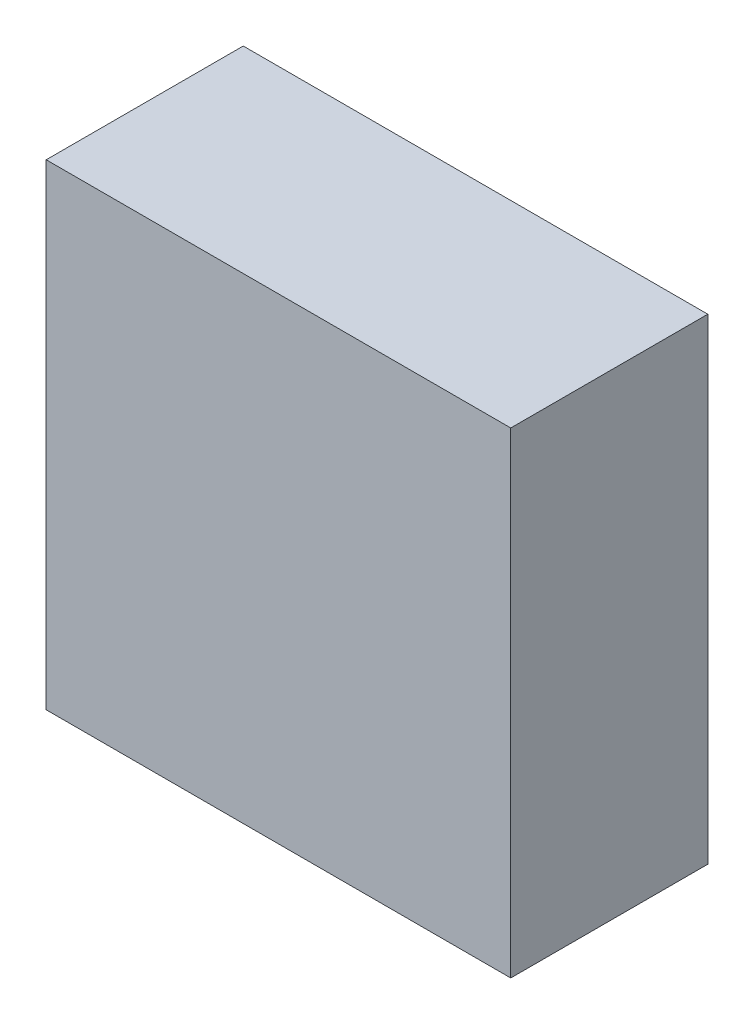
ISO-10303-21;
HEADER;
FILE_DESCRIPTION(('STEP AP214'),'2;1');
FILE_NAME('part.step','',(''),(''),'','','');
FILE_SCHEMA(('AUTOMOTIVE_DESIGN { 1 0 10303 214 1 1 1 1 }'));
ENDSEC;
DATA;
#1=APPLICATION_CONTEXT('core data for automotive mechanical design processes');
#2=APPLICATION_PROTOCOL_DEFINITION('international standard','automotive_design',2000,#1);
#3=PRODUCT_CONTEXT('',#1,'mechanical');
#4=PRODUCT('Part','Part','',(#3));
#5=PRODUCT_RELATED_PRODUCT_CATEGORY('part','',(#4));
#6=PRODUCT_DEFINITION_FORMATION('','',#4);
#7=PRODUCT_DEFINITION_CONTEXT('part definition',#1,'design');
#8=PRODUCT_DEFINITION('design','',#6,#7);
#9=PRODUCT_DEFINITION_SHAPE('','',#8);
#10=(LENGTH_UNIT() NAMED_UNIT(*) SI_UNIT(.MILLI.,.METRE.));
#11=(NAMED_UNIT(*) PLANE_ANGLE_UNIT() SI_UNIT($,.RADIAN.));
#12=(NAMED_UNIT(*) SI_UNIT($,.STERADIAN.) SOLID_ANGLE_UNIT());
#13=UNCERTAINTY_MEASURE_WITH_UNIT(LENGTH_MEASURE(1.E-05),#10,'distance_accuracy_value','');
#14=(GEOMETRIC_REPRESENTATION_CONTEXT(3) GLOBAL_UNCERTAINTY_ASSIGNED_CONTEXT((#13)) GLOBAL_UNIT_ASSIGNED_CONTEXT((#10,
#11,#12)) REPRESENTATION_CONTEXT('',''));
#15=CARTESIAN_POINT('',(0.,0.,0.));
#16=DIRECTION('',(0.,0.,1.));
#17=DIRECTION('',(1.,0.,0.));
#18=AXIS2_PLACEMENT_3D('',#15,#16,#17);
#19=CARTESIAN_POINT('',(-24.5125871846065,12.1293913556656,10.));
#20=DIRECTION('',(1.,0.,0.));
#21=DIRECTION('',(0.,0.,-1.));
#22=AXIS2_PLACEMENT_3D('',#19,#20,#21);
#23=PLANE('',#22);
#24=DIRECTION('',(0.,0.,-1.));
#25=VECTOR('',#24,1.);
#26=CARTESIAN_POINT('',(-24.5125871846065,-12.0451070499224,84.7345573672973));
#27=LINE('',#26,#25);
#28=CARTESIAN_POINT('',(-24.5125871846065,-12.0451070499224,9.99999999999999));
#29=VERTEX_POINT('',#28);
#30=CARTESIAN_POINT('',(-24.5125871846065,-12.0451070499224,0.));
#31=VERTEX_POINT('',#30);
#32=EDGE_CURVE('E81',#29,#31,#27,.T.);
#33=ORIENTED_EDGE('',*,*,#32,.F.);
#34=DIRECTION('',(0.,-1.,0.));
#35=VECTOR('',#34,1.);
#36=CARTESIAN_POINT('',(-24.5125871846065,12.1293913556656,10.));
#37=LINE('',#36,#35);
#38=CARTESIAN_POINT('',(-24.5125871846065,12.1293913556656,10.));
#39=VERTEX_POINT('',#38);
#40=EDGE_CURVE('E100',#39,#29,#37,.T.);
#41=ORIENTED_EDGE('',*,*,#40,.F.);
#42=DIRECTION('',(0.,0.,-1.));
#43=VECTOR('',#42,1.);
#44=CARTESIAN_POINT('',(-24.5125871846065,12.1293913556656,10.));
#45=LINE('',#44,#43);
#46=CARTESIAN_POINT('',(-24.5125871846065,12.1293913556656,0.));
#47=VERTEX_POINT('',#46);
#48=EDGE_CURVE('E11',#39,#47,#45,.T.);
#49=ORIENTED_EDGE('',*,*,#48,.T.);
#50=DIRECTION('',(0.,-1.,0.));
#51=VECTOR('',#50,1.);
#52=CARTESIAN_POINT('',(-24.5125871846065,12.1293913556656,0.));
#53=LINE('',#52,#51);
#54=EDGE_CURVE('E103',#47,#31,#53,.T.);
#55=ORIENTED_EDGE('',*,*,#54,.T.);
#56=EDGE_LOOP('',(#33,#41,#49,#55));
#57=FACE_BOUND('',#56,.T.);
#58=ADVANCED_FACE('F34',(#57),#23,.F.);
#59=CARTESIAN_POINT('',(-24.5125871846065,12.1293913556656,10.));
#60=DIRECTION('',(0.,-1.,0.));
#61=DIRECTION('',(0.,0.,-1.));
#62=AXIS2_PLACEMENT_3D('',#59,#60,#61);
#63=PLANE('',#62);
#64=DIRECTION('',(-1.,0.,0.));
#65=VECTOR('',#64,1.);
#66=CARTESIAN_POINT('',(-24.5125871846065,12.1293913556656,10.));
#67=LINE('',#66,#65);
#68=CARTESIAN_POINT('',(-0.937210749999265,12.1293913556656,9.99999999999999));
#69=VERTEX_POINT('',#68);
#70=EDGE_CURVE('E41',#69,#39,#67,.T.);
#71=ORIENTED_EDGE('',*,*,#70,.F.);
#72=DIRECTION('',(0.,0.,-1.));
#73=VECTOR('',#72,1.);
#74=CARTESIAN_POINT('',(-0.937210749999265,12.1293913556656,84.7345573672973));
#75=LINE('',#74,#73);
#76=CARTESIAN_POINT('',(-0.937210749999265,12.1293913556656,0.));
#77=VERTEX_POINT('',#76);
#78=EDGE_CURVE('E85',#69,#77,#75,.T.);
#79=ORIENTED_EDGE('',*,*,#78,.T.);
#80=DIRECTION('',(-1.,0.,0.));
#81=VECTOR('',#80,1.);
#82=CARTESIAN_POINT('',(-24.5125871846065,12.1293913556656,0.));
#83=LINE('',#82,#81);
#84=EDGE_CURVE('E93',#77,#47,#83,.T.);
#85=ORIENTED_EDGE('',*,*,#84,.T.);
#86=ORIENTED_EDGE('',*,*,#48,.F.);
#87=EDGE_LOOP('',(#71,#79,#85,#86));
#88=FACE_BOUND('',#87,.T.);
#89=ADVANCED_FACE('F105',(#88),#63,.F.);
#90=CARTESIAN_POINT('',(0.,0.,0.));
#91=DIRECTION('',(0.,0.,1.));
#92=DIRECTION('',(1.,0.,0.));
#93=AXIS2_PLACEMENT_3D('',#90,#91,#92);
#94=PLANE('',#93);
#95=ORIENTED_EDGE('',*,*,#84,.F.);
#96=DIRECTION('',(0.,-1.,0.));
#97=VECTOR('',#96,1.);
#98=CARTESIAN_POINT('',(-0.937210749999265,12.1293913556656,0.));
#99=LINE('',#98,#97);
#100=CARTESIAN_POINT('',(-0.937210749999265,-12.0451070499224,0.));
#101=VERTEX_POINT('',#100);
#102=EDGE_CURVE('E48',#77,#101,#99,.T.);
#103=ORIENTED_EDGE('',*,*,#102,.T.);
#104=DIRECTION('',(-1.,0.,0.));
#105=VECTOR('',#104,1.);
#106=CARTESIAN_POINT('',(-0.937210749999265,-12.0451070499224,0.));
#107=LINE('',#106,#105);
#108=EDGE_CURVE('E76',#101,#31,#107,.T.);
#109=ORIENTED_EDGE('',*,*,#108,.T.);
#110=ORIENTED_EDGE('',*,*,#54,.F.);
#111=EDGE_LOOP('',(#95,#103,#109,#110));
#112=FACE_BOUND('',#111,.T.);
#113=ADVANCED_FACE('F92',(#112),#94,.F.);
#114=CARTESIAN_POINT('',(-0.937210749999265,-12.0451070499224,84.7345573672973));
#115=DIRECTION('',(0.,-1.,0.));
#116=DIRECTION('',(0.,0.,-1.));
#117=AXIS2_PLACEMENT_3D('',#114,#115,#116);
#118=PLANE('',#117);
#119=DIRECTION('',(0.,0.,-1.));
#120=VECTOR('',#119,1.);
#121=CARTESIAN_POINT('',(-0.937210749999265,-12.0451070499224,84.7345573672973));
#122=LINE('',#121,#120);
#123=CARTESIAN_POINT('',(-0.937210749999265,-12.0451070499224,9.99999999999999));
#124=VERTEX_POINT('',#123);
#125=EDGE_CURVE('E78',#124,#101,#122,.T.);
#126=ORIENTED_EDGE('',*,*,#125,.F.);
#127=DIRECTION('',(-1.,0.,0.));
#128=VECTOR('',#127,1.);
#129=CARTESIAN_POINT('',(-0.937210749999265,-12.0451070499224,9.99999999999999));
#130=LINE('',#129,#128);
#131=EDGE_CURVE('E89',#124,#29,#130,.T.);
#132=ORIENTED_EDGE('',*,*,#131,.T.);
#133=ORIENTED_EDGE('',*,*,#32,.T.);
#134=ORIENTED_EDGE('',*,*,#108,.F.);
#135=EDGE_LOOP('',(#126,#132,#133,#134));
#136=FACE_BOUND('',#135,.T.);
#137=ADVANCED_FACE('F77',(#136),#118,.T.);
#138=CARTESIAN_POINT('',(-0.937210749999265,12.1293913556656,84.7345573672973));
#139=DIRECTION('',(1.,0.,0.));
#140=DIRECTION('',(0.,0.,-1.));
#141=AXIS2_PLACEMENT_3D('',#138,#139,#140);
#142=PLANE('',#141);
#143=ORIENTED_EDGE('',*,*,#78,.F.);
#144=DIRECTION('',(0.,-1.,0.));
#145=VECTOR('',#144,1.);
#146=CARTESIAN_POINT('',(-0.937210749999265,12.1293913556656,9.99999999999999));
#147=LINE('',#146,#145);
#148=EDGE_CURVE('E88',#69,#124,#147,.T.);
#149=ORIENTED_EDGE('',*,*,#148,.T.);
#150=ORIENTED_EDGE('',*,*,#125,.T.);
#151=ORIENTED_EDGE('',*,*,#102,.F.);
#152=EDGE_LOOP('',(#143,#149,#150,#151));
#153=FACE_BOUND('',#152,.T.);
#154=ADVANCED_FACE('F87',(#153),#142,.T.);
#155=CARTESIAN_POINT('',(0.,0.,10.));
#156=DIRECTION('',(0.,0.,1.));
#157=DIRECTION('',(1.,0.,0.));
#158=AXIS2_PLACEMENT_3D('',#155,#156,#157);
#159=PLANE('',#158);
#160=ORIENTED_EDGE('',*,*,#131,.F.);
#161=ORIENTED_EDGE('',*,*,#148,.F.);
#162=ORIENTED_EDGE('',*,*,#70,.T.);
#163=ORIENTED_EDGE('',*,*,#40,.T.);
#164=EDGE_LOOP('',(#160,#161,#162,#163));
#165=FACE_BOUND('',#164,.T.);
#166=ADVANCED_FACE('F108',(#165),#159,.T.);
#167=CLOSED_SHELL('',(#58,#89,#113,#137,#154,#166));
#168=MANIFOLD_SOLID_BREP('B2',#167);
#169=ADVANCED_BREP_SHAPE_REPRESENTATION('',(#18,#168),#14);
#170=SHAPE_DEFINITION_REPRESENTATION(#9,#169);
ENDSEC;
END-ISO-10303-21;
